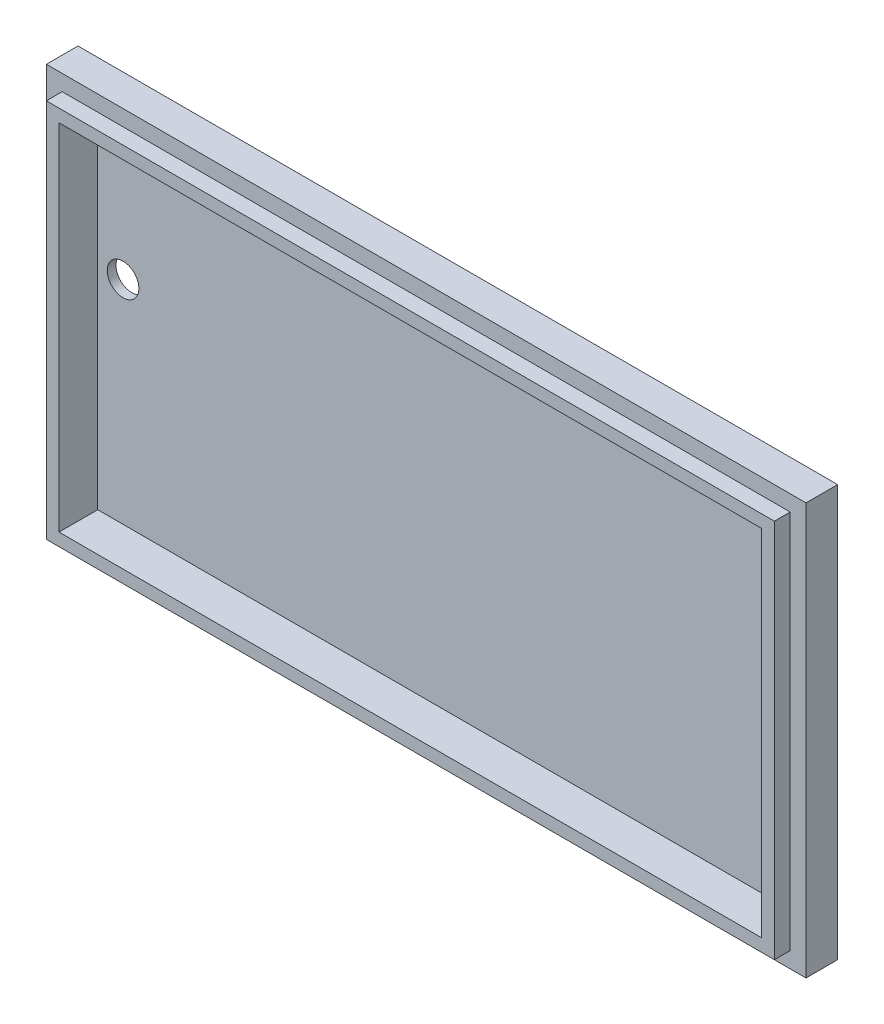
ISO-10303-21;
HEADER;
FILE_DESCRIPTION(('STEP AP214'),'2;1');
FILE_NAME('part.step','',(''),(''),'','','');
FILE_SCHEMA(('AUTOMOTIVE_DESIGN { 1 0 10303 214 1 1 1 1 }'));
ENDSEC;
DATA;
#1=APPLICATION_CONTEXT('core data for automotive mechanical design processes');
#2=APPLICATION_PROTOCOL_DEFINITION('international standard','automotive_design',2000,#1);
#3=PRODUCT_CONTEXT('',#1,'mechanical');
#4=PRODUCT('Part','Part','',(#3));
#5=PRODUCT_RELATED_PRODUCT_CATEGORY('part','',(#4));
#6=PRODUCT_DEFINITION_FORMATION('','',#4);
#7=PRODUCT_DEFINITION_CONTEXT('part definition',#1,'design');
#8=PRODUCT_DEFINITION('design','',#6,#7);
#9=PRODUCT_DEFINITION_SHAPE('','',#8);
#10=(LENGTH_UNIT() NAMED_UNIT(*) SI_UNIT(.MILLI.,.METRE.));
#11=(NAMED_UNIT(*) PLANE_ANGLE_UNIT() SI_UNIT($,.RADIAN.));
#12=(NAMED_UNIT(*) SI_UNIT($,.STERADIAN.) SOLID_ANGLE_UNIT());
#13=UNCERTAINTY_MEASURE_WITH_UNIT(LENGTH_MEASURE(1.E-05),#10,'distance_accuracy_value','');
#14=(GEOMETRIC_REPRESENTATION_CONTEXT(3) GLOBAL_UNCERTAINTY_ASSIGNED_CONTEXT((#13)) GLOBAL_UNIT_ASSIGNED_CONTEXT((#10,
#11,#12)) REPRESENTATION_CONTEXT('',''));
#15=CARTESIAN_POINT('',(0.,0.,0.));
#16=DIRECTION('',(0.,0.,1.));
#17=DIRECTION('',(1.,0.,0.));
#18=AXIS2_PLACEMENT_3D('',#15,#16,#17);
#19=CARTESIAN_POINT('',(0.,65.,-2.5));
#20=DIRECTION('',(-1.,0.,0.));
#21=DIRECTION('',(0.,0.,1.));
#22=AXIS2_PLACEMENT_3D('',#19,#20,#21);
#23=PLANE('',#22);
#24=DIRECTION('',(0.,-1.,0.));
#25=VECTOR('',#24,1.);
#26=CARTESIAN_POINT('',(0.,65.,2.5));
#27=LINE('',#26,#25);
#28=CARTESIAN_POINT('',(0.,65.,2.5));
#29=VERTEX_POINT('',#28);
#30=CARTESIAN_POINT('',(0.,0.,2.5));
#31=VERTEX_POINT('',#30);
#32=EDGE_CURVE('E197',#29,#31,#27,.T.);
#33=ORIENTED_EDGE('',*,*,#32,.F.);
#34=DIRECTION('',(0.,0.,1.));
#35=VECTOR('',#34,1.);
#36=CARTESIAN_POINT('',(0.,65.,-2.5));
#37=LINE('',#36,#35);
#38=CARTESIAN_POINT('',(0.,65.,-2.5));
#39=VERTEX_POINT('',#38);
#40=EDGE_CURVE('E11',#39,#29,#37,.T.);
#41=ORIENTED_EDGE('',*,*,#40,.F.);
#42=DIRECTION('',(0.,-1.,0.));
#43=VECTOR('',#42,1.);
#44=CARTESIAN_POINT('',(0.,65.,-2.5));
#45=LINE('',#44,#43);
#46=CARTESIAN_POINT('',(0.,0.,-2.5));
#47=VERTEX_POINT('',#46);
#48=EDGE_CURVE('E198',#39,#47,#45,.T.);
#49=ORIENTED_EDGE('',*,*,#48,.T.);
#50=DIRECTION('',(0.,0.,1.));
#51=VECTOR('',#50,1.);
#52=CARTESIAN_POINT('',(0.,0.,-2.5));
#53=LINE('',#52,#51);
#54=EDGE_CURVE('E211',#47,#31,#53,.T.);
#55=ORIENTED_EDGE('',*,*,#54,.T.);
#56=EDGE_LOOP('',(#33,#41,#49,#55));
#57=FACE_BOUND('',#56,.T.);
#58=ADVANCED_FACE('F36',(#57),#23,.T.);
#59=CARTESIAN_POINT('',(120.,65.,-2.5));
#60=DIRECTION('',(0.,1.,0.));
#61=DIRECTION('',(0.,0.,1.));
#62=AXIS2_PLACEMENT_3D('',#59,#60,#61);
#63=PLANE('',#62);
#64=DIRECTION('',(-1.,0.,0.));
#65=VECTOR('',#64,1.);
#66=CARTESIAN_POINT('',(120.,65.,2.5));
#67=LINE('',#66,#65);
#68=CARTESIAN_POINT('',(120.,65.,2.5));
#69=VERTEX_POINT('',#68);
#70=EDGE_CURVE('E202',#69,#29,#67,.T.);
#71=ORIENTED_EDGE('',*,*,#70,.F.);
#72=DIRECTION('',(0.,0.,1.));
#73=VECTOR('',#72,1.);
#74=CARTESIAN_POINT('',(120.,65.,-2.5));
#75=LINE('',#74,#73);
#76=CARTESIAN_POINT('',(120.,65.,-2.5));
#77=VERTEX_POINT('',#76);
#78=EDGE_CURVE('E44',#77,#69,#75,.T.);
#79=ORIENTED_EDGE('',*,*,#78,.F.);
#80=DIRECTION('',(-1.,0.,0.));
#81=VECTOR('',#80,1.);
#82=CARTESIAN_POINT('',(120.,65.,-2.5));
#83=LINE('',#82,#81);
#84=EDGE_CURVE('E208',#77,#39,#83,.T.);
#85=ORIENTED_EDGE('',*,*,#84,.T.);
#86=ORIENTED_EDGE('',*,*,#40,.T.);
#87=EDGE_LOOP('',(#71,#79,#85,#86));
#88=FACE_BOUND('',#87,.T.);
#89=ADVANCED_FACE('F236',(#88),#63,.T.);
#90=CARTESIAN_POINT('',(120.,0.,-2.5));
#91=DIRECTION('',(1.,0.,0.));
#92=DIRECTION('',(0.,0.,-1.));
#93=AXIS2_PLACEMENT_3D('',#90,#91,#92);
#94=PLANE('',#93);
#95=DIRECTION('',(0.,1.,0.));
#96=VECTOR('',#95,1.);
#97=CARTESIAN_POINT('',(120.,0.,2.5));
#98=LINE('',#97,#96);
#99=CARTESIAN_POINT('',(120.,0.,2.5));
#100=VERTEX_POINT('',#99);
#101=EDGE_CURVE('E217',#100,#69,#98,.T.);
#102=ORIENTED_EDGE('',*,*,#101,.F.);
#103=DIRECTION('',(0.,0.,1.));
#104=VECTOR('',#103,1.);
#105=CARTESIAN_POINT('',(120.,0.,-2.5));
#106=LINE('',#105,#104);
#107=CARTESIAN_POINT('',(120.,0.,-2.5));
#108=VERTEX_POINT('',#107);
#109=EDGE_CURVE('E223',#108,#100,#106,.T.);
#110=ORIENTED_EDGE('',*,*,#109,.F.);
#111=DIRECTION('',(0.,1.,0.));
#112=VECTOR('',#111,1.);
#113=CARTESIAN_POINT('',(120.,0.,-2.5));
#114=LINE('',#113,#112);
#115=EDGE_CURVE('E205',#108,#77,#114,.T.);
#116=ORIENTED_EDGE('',*,*,#115,.T.);
#117=ORIENTED_EDGE('',*,*,#78,.T.);
#118=EDGE_LOOP('',(#102,#110,#116,#117));
#119=FACE_BOUND('',#118,.T.);
#120=ADVANCED_FACE('F242',(#119),#94,.T.);
#121=CARTESIAN_POINT('',(0.,0.,-2.5));
#122=DIRECTION('',(0.,-1.,0.));
#123=DIRECTION('',(0.,0.,-1.));
#124=AXIS2_PLACEMENT_3D('',#121,#122,#123);
#125=PLANE('',#124);
#126=DIRECTION('',(1.,0.,0.));
#127=VECTOR('',#126,1.);
#128=CARTESIAN_POINT('',(0.,0.,2.5));
#129=LINE('',#128,#127);
#130=EDGE_CURVE('E214',#31,#100,#129,.T.);
#131=ORIENTED_EDGE('',*,*,#130,.F.);
#132=ORIENTED_EDGE('',*,*,#54,.F.);
#133=DIRECTION('',(1.,0.,0.));
#134=VECTOR('',#133,1.);
#135=CARTESIAN_POINT('',(0.,0.,-2.5));
#136=LINE('',#135,#134);
#137=EDGE_CURVE('E201',#47,#108,#136,.T.);
#138=ORIENTED_EDGE('',*,*,#137,.T.);
#139=ORIENTED_EDGE('',*,*,#109,.T.);
#140=EDGE_LOOP('',(#131,#132,#138,#139));
#141=FACE_BOUND('',#140,.T.);
#142=ADVANCED_FACE('F230',(#141),#125,.T.);
#143=CARTESIAN_POINT('',(0.,0.,-2.5));
#144=DIRECTION('',(0.,0.,1.));
#145=DIRECTION('',(1.,0.,0.));
#146=AXIS2_PLACEMENT_3D('',#143,#144,#145);
#147=PLANE('',#146);
#148=CARTESIAN_POINT('',(8.50000000000001,38.,-2.5));
#149=DIRECTION('',(0.,0.,-1.));
#150=DIRECTION('',(-1.,0.,0.));
#151=AXIS2_PLACEMENT_3D('',#148,#149,#150);
#152=CIRCLE('',#151,2.49999999999999);
#153=CARTESIAN_POINT('',(6.00000000000002,38.,-2.5));
#154=VERTEX_POINT('',#153);
#155=EDGE_CURVE('E164',#154,#154,#152,.T.);
#156=ORIENTED_EDGE('',*,*,#155,.F.);
#157=EDGE_LOOP('',(#156));
#158=FACE_BOUND('',#157,.T.);
#159=ORIENTED_EDGE('',*,*,#48,.F.);
#160=ORIENTED_EDGE('',*,*,#84,.F.);
#161=ORIENTED_EDGE('',*,*,#115,.F.);
#162=ORIENTED_EDGE('',*,*,#137,.F.);
#163=EDGE_LOOP('',(#159,#160,#161,#162));
#164=FACE_BOUND('',#163,.T.);
#165=ADVANCED_FACE('F239',(#158,#164),#147,.F.);
#166=CARTESIAN_POINT('',(0.,0.,2.5));
#167=DIRECTION('',(0.,0.,1.));
#168=DIRECTION('',(1.,0.,0.));
#169=AXIS2_PLACEMENT_3D('',#166,#167,#168);
#170=PLANE('',#169);
#171=DIRECTION('',(0.,1.,0.));
#172=VECTOR('',#171,1.);
#173=CARTESIAN_POINT('',(117.5,62.5,2.5));
#174=LINE('',#173,#172);
#175=CARTESIAN_POINT('',(117.5,2.5,2.5));
#176=VERTEX_POINT('',#175);
#177=CARTESIAN_POINT('',(117.5,62.5,2.5));
#178=VERTEX_POINT('',#177);
#179=EDGE_CURVE('E60',#176,#178,#174,.T.);
#180=ORIENTED_EDGE('',*,*,#179,.F.);
#181=DIRECTION('',(1.,0.,0.));
#182=VECTOR('',#181,1.);
#183=CARTESIAN_POINT('',(117.5,2.5,2.5));
#184=LINE('',#183,#182);
#185=CARTESIAN_POINT('',(2.5,2.5,2.5));
#186=VERTEX_POINT('',#185);
#187=EDGE_CURVE('E171',#186,#176,#184,.T.);
#188=ORIENTED_EDGE('',*,*,#187,.F.);
#189=DIRECTION('',(0.,-1.,0.));
#190=VECTOR('',#189,1.);
#191=CARTESIAN_POINT('',(2.5,2.5,2.5));
#192=LINE('',#191,#190);
#193=CARTESIAN_POINT('',(2.5,62.5,2.5));
#194=VERTEX_POINT('',#193);
#195=EDGE_CURVE('E182',#194,#186,#192,.T.);
#196=ORIENTED_EDGE('',*,*,#195,.F.);
#197=DIRECTION('',(-1.,0.,0.));
#198=VECTOR('',#197,1.);
#199=CARTESIAN_POINT('',(2.5,62.5,2.5));
#200=LINE('',#199,#198);
#201=EDGE_CURVE('E179',#178,#194,#200,.T.);
#202=ORIENTED_EDGE('',*,*,#201,.F.);
#203=EDGE_LOOP('',(#180,#188,#196,#202));
#204=FACE_BOUND('',#203,.T.);
#205=ORIENTED_EDGE('',*,*,#32,.T.);
#206=ORIENTED_EDGE('',*,*,#130,.T.);
#207=ORIENTED_EDGE('',*,*,#101,.T.);
#208=ORIENTED_EDGE('',*,*,#70,.T.);
#209=EDGE_LOOP('',(#205,#206,#207,#208));
#210=FACE_BOUND('',#209,.T.);
#211=ADVANCED_FACE('F233',(#204,#210),#170,.T.);
#212=CARTESIAN_POINT('',(117.5,62.5,5.));
#213=DIRECTION('',(-1.,0.,0.));
#214=DIRECTION('',(0.,0.,1.));
#215=AXIS2_PLACEMENT_3D('',#212,#213,#214);
#216=PLANE('',#215);
#217=ORIENTED_EDGE('',*,*,#179,.T.);
#218=DIRECTION('',(0.,0.,-1.));
#219=VECTOR('',#218,1.);
#220=CARTESIAN_POINT('',(117.5,62.5,5.));
#221=LINE('',#220,#219);
#222=CARTESIAN_POINT('',(117.5,62.5,5.));
#223=VERTEX_POINT('',#222);
#224=EDGE_CURVE('E194',#223,#178,#221,.T.);
#225=ORIENTED_EDGE('',*,*,#224,.F.);
#226=DIRECTION('',(0.,1.,0.));
#227=VECTOR('',#226,1.);
#228=CARTESIAN_POINT('',(117.5,62.5,5.));
#229=LINE('',#228,#227);
#230=CARTESIAN_POINT('',(117.5,2.5,5.));
#231=VERTEX_POINT('',#230);
#232=EDGE_CURVE('E167',#231,#223,#229,.T.);
#233=ORIENTED_EDGE('',*,*,#232,.F.);
#234=DIRECTION('',(0.,0.,-1.));
#235=VECTOR('',#234,1.);
#236=CARTESIAN_POINT('',(117.5,2.5,5.));
#237=LINE('',#236,#235);
#238=EDGE_CURVE('E177',#231,#176,#237,.T.);
#239=ORIENTED_EDGE('',*,*,#238,.T.);
#240=EDGE_LOOP('',(#217,#225,#233,#239));
#241=FACE_BOUND('',#240,.T.);
#242=ADVANCED_FACE('F278',(#241),#216,.F.);
#243=CARTESIAN_POINT('',(2.5,62.5,5.));
#244=DIRECTION('',(0.,-1.,0.));
#245=DIRECTION('',(0.,0.,-1.));
#246=AXIS2_PLACEMENT_3D('',#243,#244,#245);
#247=PLANE('',#246);
#248=ORIENTED_EDGE('',*,*,#201,.T.);
#249=DIRECTION('',(0.,0.,-1.));
#250=VECTOR('',#249,1.);
#251=CARTESIAN_POINT('',(2.5,62.5,5.));
#252=LINE('',#251,#250);
#253=CARTESIAN_POINT('',(2.5,62.5,5.));
#254=VERTEX_POINT('',#253);
#255=EDGE_CURVE('E191',#254,#194,#252,.T.);
#256=ORIENTED_EDGE('',*,*,#255,.F.);
#257=DIRECTION('',(-1.,0.,0.));
#258=VECTOR('',#257,1.);
#259=CARTESIAN_POINT('',(2.5,62.5,5.));
#260=LINE('',#259,#258);
#261=EDGE_CURVE('E170',#223,#254,#260,.T.);
#262=ORIENTED_EDGE('',*,*,#261,.F.);
#263=ORIENTED_EDGE('',*,*,#224,.T.);
#264=EDGE_LOOP('',(#248,#256,#262,#263));
#265=FACE_BOUND('',#264,.T.);
#266=ADVANCED_FACE('F287',(#265),#247,.F.);
#267=CARTESIAN_POINT('',(2.5,2.5,5.));
#268=DIRECTION('',(1.,0.,0.));
#269=DIRECTION('',(0.,0.,-1.));
#270=AXIS2_PLACEMENT_3D('',#267,#268,#269);
#271=PLANE('',#270);
#272=ORIENTED_EDGE('',*,*,#195,.T.);
#273=DIRECTION('',(0.,0.,-1.));
#274=VECTOR('',#273,1.);
#275=CARTESIAN_POINT('',(2.5,2.5,5.));
#276=LINE('',#275,#274);
#277=CARTESIAN_POINT('',(2.5,2.5,5.));
#278=VERTEX_POINT('',#277);
#279=EDGE_CURVE('E188',#278,#186,#276,.T.);
#280=ORIENTED_EDGE('',*,*,#279,.F.);
#281=DIRECTION('',(0.,-1.,0.));
#282=VECTOR('',#281,1.);
#283=CARTESIAN_POINT('',(2.5,2.5,5.));
#284=LINE('',#283,#282);
#285=EDGE_CURVE('E173',#254,#278,#284,.T.);
#286=ORIENTED_EDGE('',*,*,#285,.F.);
#287=ORIENTED_EDGE('',*,*,#255,.T.);
#288=EDGE_LOOP('',(#272,#280,#286,#287));
#289=FACE_BOUND('',#288,.T.);
#290=ADVANCED_FACE('F297',(#289),#271,.F.);
#291=CARTESIAN_POINT('',(117.5,2.5,5.));
#292=DIRECTION('',(0.,1.,0.));
#293=DIRECTION('',(0.,0.,1.));
#294=AXIS2_PLACEMENT_3D('',#291,#292,#293);
#295=PLANE('',#294);
#296=ORIENTED_EDGE('',*,*,#187,.T.);
#297=ORIENTED_EDGE('',*,*,#238,.F.);
#298=DIRECTION('',(1.,0.,0.));
#299=VECTOR('',#298,1.);
#300=CARTESIAN_POINT('',(117.5,2.5,5.));
#301=LINE('',#300,#299);
#302=EDGE_CURVE('E175',#278,#231,#301,.T.);
#303=ORIENTED_EDGE('',*,*,#302,.F.);
#304=ORIENTED_EDGE('',*,*,#279,.T.);
#305=EDGE_LOOP('',(#296,#297,#303,#304));
#306=FACE_BOUND('',#305,.T.);
#307=ADVANCED_FACE('F307',(#306),#295,.F.);
#308=CARTESIAN_POINT('',(0.,0.,5.));
#309=DIRECTION('',(0.,0.,-1.));
#310=DIRECTION('',(-1.,0.,0.));
#311=AXIS2_PLACEMENT_3D('',#308,#309,#310);
#312=PLANE('',#311);
#313=DIRECTION('',(0.,-1.,0.));
#314=VECTOR('',#313,1.);
#315=CARTESIAN_POINT('',(115.5,60.5,5.));
#316=LINE('',#315,#314);
#317=CARTESIAN_POINT('',(115.5,60.5,5.));
#318=VERTEX_POINT('',#317);
#319=CARTESIAN_POINT('',(115.5,4.5,5.));
#320=VERTEX_POINT('',#319);
#321=EDGE_CURVE('E155',#318,#320,#316,.T.);
#322=ORIENTED_EDGE('',*,*,#321,.T.);
#323=DIRECTION('',(1.,0.,0.));
#324=VECTOR('',#323,1.);
#325=CARTESIAN_POINT('',(4.50000000000001,4.5,5.));
#326=LINE('',#325,#324);
#327=CARTESIAN_POINT('',(4.50000000000001,4.5,5.));
#328=VERTEX_POINT('',#327);
#329=EDGE_CURVE('E52',#328,#320,#326,.T.);
#330=ORIENTED_EDGE('',*,*,#329,.F.);
#331=DIRECTION('',(0.,-1.,0.));
#332=VECTOR('',#331,1.);
#333=CARTESIAN_POINT('',(4.5,60.5,5.));
#334=LINE('',#333,#332);
#335=CARTESIAN_POINT('',(4.5,60.5,5.));
#336=VERTEX_POINT('',#335);
#337=EDGE_CURVE('E146',#336,#328,#334,.T.);
#338=ORIENTED_EDGE('',*,*,#337,.F.);
#339=DIRECTION('',(1.,0.,0.));
#340=VECTOR('',#339,1.);
#341=CARTESIAN_POINT('',(4.5,60.5,5.));
#342=LINE('',#341,#340);
#343=EDGE_CURVE('E149',#336,#318,#342,.T.);
#344=ORIENTED_EDGE('',*,*,#343,.T.);
#345=EDGE_LOOP('',(#322,#330,#338,#344));
#346=FACE_BOUND('',#345,.T.);
#347=ORIENTED_EDGE('',*,*,#232,.T.);
#348=ORIENTED_EDGE('',*,*,#261,.T.);
#349=ORIENTED_EDGE('',*,*,#285,.T.);
#350=ORIENTED_EDGE('',*,*,#302,.T.);
#351=EDGE_LOOP('',(#347,#348,#349,#350));
#352=FACE_BOUND('',#351,.T.);
#353=ADVANCED_FACE('F317',(#346,#352),#312,.F.);
#354=CARTESIAN_POINT('',(8.50000000000001,38.,-2.5));
#355=DIRECTION('',(0.,0.,-1.));
#356=DIRECTION('',(-1.,0.,0.));
#357=AXIS2_PLACEMENT_3D('',#354,#355,#356);
#358=CYLINDRICAL_SURFACE('',#357,2.49999999999999);
#359=CARTESIAN_POINT('',(8.50000000000001,38.,-1.12));
#360=DIRECTION('',(0.,0.,-1.));
#361=DIRECTION('',(-1.,0.,0.));
#362=AXIS2_PLACEMENT_3D('',#359,#360,#361);
#363=CIRCLE('',#362,2.49999999999999);
#364=CARTESIAN_POINT('',(6.00000000000001,38.,-1.12));
#365=VERTEX_POINT('',#364);
#366=EDGE_CURVE('E39',#365,#365,#363,.F.);
#367=ORIENTED_EDGE('',*,*,#366,.T.);
#368=EDGE_LOOP('',(#367));
#369=FACE_BOUND('',#368,.T.);
#370=ORIENTED_EDGE('',*,*,#155,.T.);
#371=EDGE_LOOP('',(#370));
#372=FACE_BOUND('',#371,.T.);
#373=ADVANCED_FACE('F334',(#369,#372),#358,.F.);
#374=CARTESIAN_POINT('',(0.,0.,-1.12));
#375=DIRECTION('',(0.,0.,-1.));
#376=DIRECTION('',(-1.,0.,0.));
#377=AXIS2_PLACEMENT_3D('',#374,#375,#376);
#378=PLANE('',#377);
#379=DIRECTION('',(1.,0.,0.));
#380=VECTOR('',#379,1.);
#381=CARTESIAN_POINT('',(4.50000000000001,4.5,-1.12));
#382=LINE('',#381,#380);
#383=CARTESIAN_POINT('',(4.50000000000001,4.5,-1.12));
#384=VERTEX_POINT('',#383);
#385=CARTESIAN_POINT('',(115.5,4.5,-1.12));
#386=VERTEX_POINT('',#385);
#387=EDGE_CURVE('E136',#384,#386,#382,.T.);
#388=ORIENTED_EDGE('',*,*,#387,.T.);
#389=DIRECTION('',(0.,-1.,0.));
#390=VECTOR('',#389,1.);
#391=CARTESIAN_POINT('',(115.5,60.5,-1.12));
#392=LINE('',#391,#390);
#393=CARTESIAN_POINT('',(115.5,60.5,-1.12));
#394=VERTEX_POINT('',#393);
#395=EDGE_CURVE('E126',#394,#386,#392,.T.);
#396=ORIENTED_EDGE('',*,*,#395,.F.);
#397=DIRECTION('',(1.,0.,0.));
#398=VECTOR('',#397,1.);
#399=CARTESIAN_POINT('',(4.5,60.5,-1.12));
#400=LINE('',#399,#398);
#401=CARTESIAN_POINT('',(4.5,60.5,-1.12));
#402=VERTEX_POINT('',#401);
#403=EDGE_CURVE('E135',#402,#394,#400,.T.);
#404=ORIENTED_EDGE('',*,*,#403,.F.);
#405=DIRECTION('',(0.,-1.,0.));
#406=VECTOR('',#405,1.);
#407=CARTESIAN_POINT('',(4.5,60.5,-1.12));
#408=LINE('',#407,#406);
#409=EDGE_CURVE('E141',#402,#384,#408,.T.);
#410=ORIENTED_EDGE('',*,*,#409,.T.);
#411=EDGE_LOOP('',(#388,#396,#404,#410));
#412=FACE_BOUND('',#411,.T.);
#413=ORIENTED_EDGE('',*,*,#366,.F.);
#414=EDGE_LOOP('',(#413));
#415=FACE_BOUND('',#414,.T.);
#416=ADVANCED_FACE('F143',(#412,#415),#378,.F.);
#417=CARTESIAN_POINT('',(4.50000000000001,4.5,-1.12));
#418=DIRECTION('',(0.,-1.,0.));
#419=DIRECTION('',(0.,0.,-1.));
#420=AXIS2_PLACEMENT_3D('',#417,#418,#419);
#421=PLANE('',#420);
#422=ORIENTED_EDGE('',*,*,#329,.T.);
#423=DIRECTION('',(0.,0.,1.));
#424=VECTOR('',#423,1.);
#425=CARTESIAN_POINT('',(115.5,4.5,-1.12));
#426=LINE('',#425,#424);
#427=EDGE_CURVE('E129',#386,#320,#426,.T.);
#428=ORIENTED_EDGE('',*,*,#427,.F.);
#429=ORIENTED_EDGE('',*,*,#387,.F.);
#430=DIRECTION('',(0.,0.,1.));
#431=VECTOR('',#430,1.);
#432=CARTESIAN_POINT('',(4.50000000000001,4.5,-1.12));
#433=LINE('',#432,#431);
#434=EDGE_CURVE('E159',#384,#328,#433,.T.);
#435=ORIENTED_EDGE('',*,*,#434,.T.);
#436=EDGE_LOOP('',(#422,#428,#429,#435));
#437=FACE_BOUND('',#436,.T.);
#438=ADVANCED_FACE('F139',(#437),#421,.F.);
#439=CARTESIAN_POINT('',(4.5,60.5,-1.12));
#440=DIRECTION('',(-1.,0.,0.));
#441=DIRECTION('',(0.,-1.,0.));
#442=AXIS2_PLACEMENT_3D('',#439,#440,#441);
#443=PLANE('',#442);
#444=ORIENTED_EDGE('',*,*,#337,.T.);
#445=ORIENTED_EDGE('',*,*,#434,.F.);
#446=ORIENTED_EDGE('',*,*,#409,.F.);
#447=DIRECTION('',(0.,0.,1.));
#448=VECTOR('',#447,1.);
#449=CARTESIAN_POINT('',(4.5,60.5,-1.12));
#450=LINE('',#449,#448);
#451=EDGE_CURVE('E161',#402,#336,#450,.T.);
#452=ORIENTED_EDGE('',*,*,#451,.T.);
#453=EDGE_LOOP('',(#444,#445,#446,#452));
#454=FACE_BOUND('',#453,.T.);
#455=ADVANCED_FACE('F361',(#454),#443,.F.);
#456=CARTESIAN_POINT('',(4.5,60.5,-1.12));
#457=DIRECTION('',(0.,-1.,0.));
#458=DIRECTION('',(0.,0.,-1.));
#459=AXIS2_PLACEMENT_3D('',#456,#457,#458);
#460=PLANE('',#459);
#461=ORIENTED_EDGE('',*,*,#343,.F.);
#462=ORIENTED_EDGE('',*,*,#451,.F.);
#463=ORIENTED_EDGE('',*,*,#403,.T.);
#464=DIRECTION('',(0.,0.,1.));
#465=VECTOR('',#464,1.);
#466=CARTESIAN_POINT('',(115.5,60.5,-1.12));
#467=LINE('',#466,#465);
#468=EDGE_CURVE('E131',#394,#318,#467,.T.);
#469=ORIENTED_EDGE('',*,*,#468,.T.);
#470=EDGE_LOOP('',(#461,#462,#463,#469));
#471=FACE_BOUND('',#470,.T.);
#472=ADVANCED_FACE('F370',(#471),#460,.T.);
#473=CARTESIAN_POINT('',(115.5,60.5,-1.12));
#474=DIRECTION('',(-1.,0.,0.));
#475=DIRECTION('',(0.,-1.,0.));
#476=AXIS2_PLACEMENT_3D('',#473,#474,#475);
#477=PLANE('',#476);
#478=ORIENTED_EDGE('',*,*,#321,.F.);
#479=ORIENTED_EDGE('',*,*,#468,.F.);
#480=ORIENTED_EDGE('',*,*,#395,.T.);
#481=ORIENTED_EDGE('',*,*,#427,.T.);
#482=EDGE_LOOP('',(#478,#479,#480,#481));
#483=FACE_BOUND('',#482,.T.);
#484=ADVANCED_FACE('F128',(#483),#477,.T.);
#485=CLOSED_SHELL('',(#58,#89,#120,#142,#165,#211,#242,#266,#290,#307,#353,#373,#416,#438,#455,
#472,#484));
#486=MANIFOLD_SOLID_BREP('B2',#485);
#487=ADVANCED_BREP_SHAPE_REPRESENTATION('',(#18,#486),#14);
#488=SHAPE_DEFINITION_REPRESENTATION(#9,#487);
ENDSEC;
END-ISO-10303-21;
